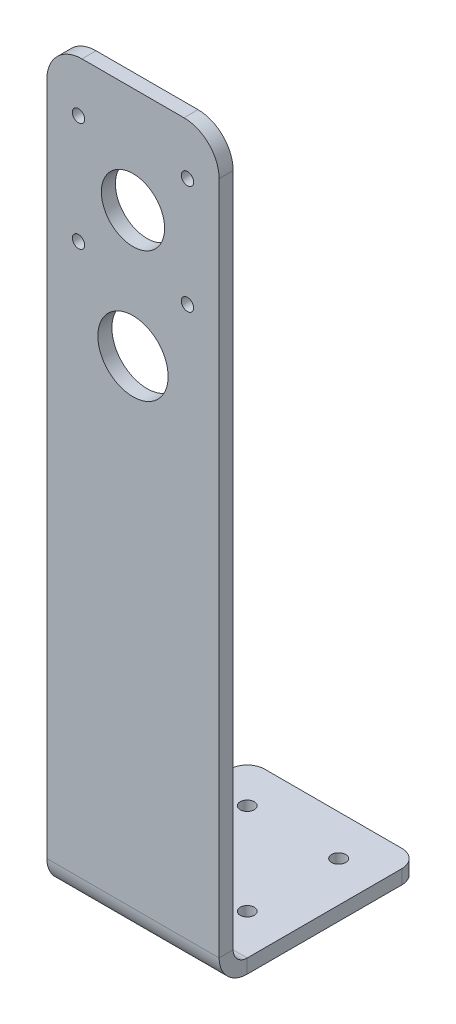
ISO-10303-21;
HEADER;
FILE_DESCRIPTION(('STEP AP214'),'2;1');
FILE_NAME('part.step','',(''),(''),'','','');
FILE_SCHEMA(('AUTOMOTIVE_DESIGN { 1 0 10303 214 1 1 1 1 }'));
ENDSEC;
DATA;
#1=APPLICATION_CONTEXT('core data for automotive mechanical design processes');
#2=APPLICATION_PROTOCOL_DEFINITION('international standard','automotive_design',2000,#1);
#3=PRODUCT_CONTEXT('',#1,'mechanical');
#4=PRODUCT('Part','Part','',(#3));
#5=PRODUCT_RELATED_PRODUCT_CATEGORY('part','',(#4));
#6=PRODUCT_DEFINITION_FORMATION('','',#4);
#7=PRODUCT_DEFINITION_CONTEXT('part definition',#1,'design');
#8=PRODUCT_DEFINITION('design','',#6,#7);
#9=PRODUCT_DEFINITION_SHAPE('','',#8);
#10=(LENGTH_UNIT() NAMED_UNIT(*) SI_UNIT(.MILLI.,.METRE.));
#11=(NAMED_UNIT(*) PLANE_ANGLE_UNIT() SI_UNIT($,.RADIAN.));
#12=(NAMED_UNIT(*) SI_UNIT($,.STERADIAN.) SOLID_ANGLE_UNIT());
#13=UNCERTAINTY_MEASURE_WITH_UNIT(LENGTH_MEASURE(1.E-05),#10,'distance_accuracy_value','');
#14=(GEOMETRIC_REPRESENTATION_CONTEXT(3) GLOBAL_UNCERTAINTY_ASSIGNED_CONTEXT((#13)) GLOBAL_UNIT_ASSIGNED_CONTEXT((#10,
#11,#12)) REPRESENTATION_CONTEXT('',''));
#15=CARTESIAN_POINT('',(0.,0.,0.));
#16=DIRECTION('',(0.,0.,1.));
#17=DIRECTION('',(1.,0.,0.));
#18=AXIS2_PLACEMENT_3D('',#15,#16,#17);
#19=CARTESIAN_POINT('',(24.5,-4.,24.5));
#20=DIRECTION('',(1.,0.,0.));
#21=DIRECTION('',(0.,0.,-1.));
#22=AXIS2_PLACEMENT_3D('',#19,#20,#21);
#23=PLANE('',#22);
#24=DIRECTION('',(0.,0.,-1.));
#25=VECTOR('',#24,1.);
#26=CARTESIAN_POINT('',(24.5,-4.,24.5));
#27=LINE('',#26,#25);
#28=CARTESIAN_POINT('',(24.5,-4.,24.5));
#29=VERTEX_POINT('',#28);
#30=CARTESIAN_POINT('',(24.5,-4.,-19.5));
#31=VERTEX_POINT('',#30);
#32=EDGE_CURVE('E235',#29,#31,#27,.T.);
#33=ORIENTED_EDGE('',*,*,#32,.T.);
#34=DIRECTION('',(0.,1.,0.));
#35=VECTOR('',#34,1.);
#36=CARTESIAN_POINT('',(24.5,-4.,-19.5));
#37=LINE('',#36,#35);
#38=CARTESIAN_POINT('',(24.5,0.,-19.5));
#39=VERTEX_POINT('',#38);
#40=EDGE_CURVE('E13',#31,#39,#37,.T.);
#41=ORIENTED_EDGE('',*,*,#40,.T.);
#42=DIRECTION('',(0.,0.,-1.));
#43=VECTOR('',#42,1.);
#44=CARTESIAN_POINT('',(24.5,0.,24.5));
#45=LINE('',#44,#43);
#46=CARTESIAN_POINT('',(24.5,0.,24.5));
#47=VERTEX_POINT('',#46);
#48=EDGE_CURVE('E232',#47,#39,#45,.T.);
#49=ORIENTED_EDGE('',*,*,#48,.F.);
#50=DIRECTION('',(0.,1.,0.));
#51=VECTOR('',#50,1.);
#52=CARTESIAN_POINT('',(24.5,-4.,24.5));
#53=LINE('',#52,#51);
#54=EDGE_CURVE('E254',#29,#47,#53,.T.);
#55=ORIENTED_EDGE('',*,*,#54,.F.);
#56=EDGE_LOOP('',(#33,#41,#49,#55));
#57=FACE_BOUND('',#56,.T.);
#58=ADVANCED_FACE('F58',(#57),#23,.T.);
#59=CARTESIAN_POINT('',(-24.5,-4.,24.5));
#60=DIRECTION('',(-1.,0.,0.));
#61=DIRECTION('',(0.,0.,1.));
#62=AXIS2_PLACEMENT_3D('',#59,#60,#61);
#63=PLANE('',#62);
#64=DIRECTION('',(0.,0.,1.));
#65=VECTOR('',#64,1.);
#66=CARTESIAN_POINT('',(-24.5,0.,24.5));
#67=LINE('',#66,#65);
#68=CARTESIAN_POINT('',(-24.5,0.,-19.5));
#69=VERTEX_POINT('',#68);
#70=CARTESIAN_POINT('',(-24.5,0.,24.5));
#71=VERTEX_POINT('',#70);
#72=EDGE_CURVE('E250',#69,#71,#67,.T.);
#73=ORIENTED_EDGE('',*,*,#72,.F.);
#74=DIRECTION('',(0.,1.,0.));
#75=VECTOR('',#74,1.);
#76=CARTESIAN_POINT('',(-24.5,-4.,-19.5));
#77=LINE('',#76,#75);
#78=CARTESIAN_POINT('',(-24.5,-4.,-19.5));
#79=VERTEX_POINT('',#78);
#80=EDGE_CURVE('E81',#69,#79,#77,.F.);
#81=ORIENTED_EDGE('',*,*,#80,.T.);
#82=DIRECTION('',(0.,0.,1.));
#83=VECTOR('',#82,1.);
#84=CARTESIAN_POINT('',(-24.5,-4.,24.5));
#85=LINE('',#84,#83);
#86=CARTESIAN_POINT('',(-24.5,-4.,24.5));
#87=VERTEX_POINT('',#86);
#88=EDGE_CURVE('E241',#79,#87,#85,.T.);
#89=ORIENTED_EDGE('',*,*,#88,.T.);
#90=DIRECTION('',(0.,1.,0.));
#91=VECTOR('',#90,1.);
#92=CARTESIAN_POINT('',(-24.5,-4.,24.5));
#93=LINE('',#92,#91);
#94=EDGE_CURVE('E244',#87,#71,#93,.T.);
#95=ORIENTED_EDGE('',*,*,#94,.T.);
#96=EDGE_LOOP('',(#73,#81,#89,#95));
#97=FACE_BOUND('',#96,.T.);
#98=ADVANCED_FACE('F296',(#97),#63,.T.);
#99=CARTESIAN_POINT('',(-24.5,-4.,-24.5));
#100=DIRECTION('',(0.,0.,-1.));
#101=DIRECTION('',(-1.,0.,0.));
#102=AXIS2_PLACEMENT_3D('',#99,#100,#101);
#103=PLANE('',#102);
#104=DIRECTION('',(-1.,0.,0.));
#105=VECTOR('',#104,1.);
#106=CARTESIAN_POINT('',(-24.5,-4.,-24.5));
#107=LINE('',#106,#105);
#108=CARTESIAN_POINT('',(19.5,-4.,-24.5));
#109=VERTEX_POINT('',#108);
#110=CARTESIAN_POINT('',(-19.5,-4.,-24.5));
#111=VERTEX_POINT('',#110);
#112=EDGE_CURVE('E237',#109,#111,#107,.T.);
#113=ORIENTED_EDGE('',*,*,#112,.T.);
#114=DIRECTION('',(0.,1.,0.));
#115=VECTOR('',#114,1.);
#116=CARTESIAN_POINT('',(-19.5,-4.,-24.5));
#117=LINE('',#116,#115);
#118=CARTESIAN_POINT('',(-19.5,0.,-24.5));
#119=VERTEX_POINT('',#118);
#120=EDGE_CURVE('E277',#111,#119,#117,.T.);
#121=ORIENTED_EDGE('',*,*,#120,.T.);
#122=DIRECTION('',(-1.,0.,0.));
#123=VECTOR('',#122,1.);
#124=CARTESIAN_POINT('',(-24.5,0.,-24.5));
#125=LINE('',#124,#123);
#126=CARTESIAN_POINT('',(19.5,0.,-24.5));
#127=VERTEX_POINT('',#126);
#128=EDGE_CURVE('E247',#127,#119,#125,.T.);
#129=ORIENTED_EDGE('',*,*,#128,.F.);
#130=DIRECTION('',(0.,1.,0.));
#131=VECTOR('',#130,1.);
#132=CARTESIAN_POINT('',(19.5,-4.,-24.5));
#133=LINE('',#132,#131);
#134=EDGE_CURVE('E275',#127,#109,#133,.F.);
#135=ORIENTED_EDGE('',*,*,#134,.T.);
#136=EDGE_LOOP('',(#113,#121,#129,#135));
#137=FACE_BOUND('',#136,.T.);
#138=ADVANCED_FACE('F290',(#137),#103,.T.);
#139=CARTESIAN_POINT('',(0.,-4.,0.));
#140=DIRECTION('',(0.,-1.,0.));
#141=DIRECTION('',(0.,0.,-1.));
#142=AXIS2_PLACEMENT_3D('',#139,#140,#141);
#143=PLANE('',#142);
#144=CARTESIAN_POINT('',(13.,-4.,13.));
#145=DIRECTION('',(0.,1.,0.));
#146=DIRECTION('',(0.,0.,1.));
#147=AXIS2_PLACEMENT_3D('',#144,#145,#146);
#148=CIRCLE('',#147,2.);
#149=CARTESIAN_POINT('',(13.,-4.,15.));
#150=VERTEX_POINT('',#149);
#151=EDGE_CURVE('E211',#150,#150,#148,.T.);
#152=ORIENTED_EDGE('',*,*,#151,.T.);
#153=EDGE_LOOP('',(#152));
#154=FACE_BOUND('',#153,.T.);
#155=CARTESIAN_POINT('',(13.,-4.,-13.));
#156=DIRECTION('',(0.,1.,0.));
#157=DIRECTION('',(0.,0.,1.));
#158=AXIS2_PLACEMENT_3D('',#155,#156,#157);
#159=CIRCLE('',#158,2.);
#160=CARTESIAN_POINT('',(13.,-4.,-11.));
#161=VERTEX_POINT('',#160);
#162=EDGE_CURVE('E217',#161,#161,#159,.T.);
#163=ORIENTED_EDGE('',*,*,#162,.T.);
#164=EDGE_LOOP('',(#163));
#165=FACE_BOUND('',#164,.T.);
#166=CARTESIAN_POINT('',(-13.,-4.,-13.));
#167=DIRECTION('',(0.,1.,0.));
#168=DIRECTION('',(0.,0.,1.));
#169=AXIS2_PLACEMENT_3D('',#166,#167,#168);
#170=CIRCLE('',#169,2.);
#171=CARTESIAN_POINT('',(-13.,-4.,-11.));
#172=VERTEX_POINT('',#171);
#173=EDGE_CURVE('E223',#172,#172,#170,.T.);
#174=ORIENTED_EDGE('',*,*,#173,.T.);
#175=EDGE_LOOP('',(#174));
#176=FACE_BOUND('',#175,.T.);
#177=CARTESIAN_POINT('',(-13.,-4.,13.));
#178=DIRECTION('',(0.,1.,0.));
#179=DIRECTION('',(0.,0.,1.));
#180=AXIS2_PLACEMENT_3D('',#177,#178,#179);
#181=CIRCLE('',#180,2.);
#182=CARTESIAN_POINT('',(-13.,-4.,15.));
#183=VERTEX_POINT('',#182);
#184=EDGE_CURVE('E229',#183,#183,#181,.T.);
#185=ORIENTED_EDGE('',*,*,#184,.T.);
#186=EDGE_LOOP('',(#185));
#187=FACE_BOUND('',#186,.T.);
#188=ORIENTED_EDGE('',*,*,#88,.F.);
#189=CARTESIAN_POINT('',(-19.5,-4.,-19.5));
#190=DIRECTION('',(0.,-1.,0.));
#191=DIRECTION('',(0.,0.,-1.));
#192=AXIS2_PLACEMENT_3D('',#189,#190,#191);
#193=CIRCLE('',#192,5.);
#194=EDGE_CURVE('E66',#79,#111,#193,.T.);
#195=ORIENTED_EDGE('',*,*,#194,.T.);
#196=ORIENTED_EDGE('',*,*,#112,.F.);
#197=CARTESIAN_POINT('',(19.5,-4.,-19.5));
#198=DIRECTION('',(0.,-1.,0.));
#199=DIRECTION('',(0.,0.,-1.));
#200=AXIS2_PLACEMENT_3D('',#197,#198,#199);
#201=CIRCLE('',#200,5.);
#202=EDGE_CURVE('E73',#109,#31,#201,.T.);
#203=ORIENTED_EDGE('',*,*,#202,.T.);
#204=ORIENTED_EDGE('',*,*,#32,.F.);
#205=DIRECTION('',(1.,0.,0.));
#206=VECTOR('',#205,1.);
#207=CARTESIAN_POINT('',(-24.5,-4.,24.5));
#208=LINE('',#207,#206);
#209=EDGE_CURVE('E158',#87,#29,#208,.T.);
#210=ORIENTED_EDGE('',*,*,#209,.F.);
#211=EDGE_LOOP('',(#188,#195,#196,#203,#204,#210));
#212=FACE_BOUND('',#211,.T.);
#213=ADVANCED_FACE('F286',(#154,#165,#176,#187,#212),#143,.T.);
#214=CARTESIAN_POINT('',(0.,0.,0.));
#215=DIRECTION('',(0.,-1.,0.));
#216=DIRECTION('',(0.,0.,-1.));
#217=AXIS2_PLACEMENT_3D('',#214,#215,#216);
#218=PLANE('',#217);
#219=CARTESIAN_POINT('',(13.,0.,13.));
#220=DIRECTION('',(0.,1.,0.));
#221=DIRECTION('',(0.,0.,1.));
#222=AXIS2_PLACEMENT_3D('',#219,#220,#221);
#223=CIRCLE('',#222,2.);
#224=CARTESIAN_POINT('',(13.,0.,15.));
#225=VERTEX_POINT('',#224);
#226=EDGE_CURVE('E206',#225,#225,#223,.T.);
#227=ORIENTED_EDGE('',*,*,#226,.F.);
#228=EDGE_LOOP('',(#227));
#229=FACE_BOUND('',#228,.T.);
#230=CARTESIAN_POINT('',(13.,0.,-13.));
#231=DIRECTION('',(0.,1.,0.));
#232=DIRECTION('',(0.,0.,1.));
#233=AXIS2_PLACEMENT_3D('',#230,#231,#232);
#234=CIRCLE('',#233,2.);
#235=CARTESIAN_POINT('',(13.,0.,-11.));
#236=VERTEX_POINT('',#235);
#237=EDGE_CURVE('E214',#236,#236,#234,.T.);
#238=ORIENTED_EDGE('',*,*,#237,.F.);
#239=EDGE_LOOP('',(#238));
#240=FACE_BOUND('',#239,.T.);
#241=CARTESIAN_POINT('',(-13.,0.,-13.));
#242=DIRECTION('',(0.,1.,0.));
#243=DIRECTION('',(0.,0.,1.));
#244=AXIS2_PLACEMENT_3D('',#241,#242,#243);
#245=CIRCLE('',#244,2.);
#246=CARTESIAN_POINT('',(-13.,0.,-11.));
#247=VERTEX_POINT('',#246);
#248=EDGE_CURVE('E220',#247,#247,#245,.T.);
#249=ORIENTED_EDGE('',*,*,#248,.F.);
#250=EDGE_LOOP('',(#249));
#251=FACE_BOUND('',#250,.T.);
#252=CARTESIAN_POINT('',(-13.,0.,13.));
#253=DIRECTION('',(0.,1.,0.));
#254=DIRECTION('',(0.,0.,1.));
#255=AXIS2_PLACEMENT_3D('',#252,#253,#254);
#256=CIRCLE('',#255,2.);
#257=CARTESIAN_POINT('',(-13.,0.,15.));
#258=VERTEX_POINT('',#257);
#259=EDGE_CURVE('E226',#258,#258,#256,.T.);
#260=ORIENTED_EDGE('',*,*,#259,.F.);
#261=EDGE_LOOP('',(#260));
#262=FACE_BOUND('',#261,.T.);
#263=ORIENTED_EDGE('',*,*,#128,.T.);
#264=CARTESIAN_POINT('',(-19.5,0.,-19.5));
#265=DIRECTION('',(0.,-1.,0.));
#266=DIRECTION('',(0.,0.,-1.));
#267=AXIS2_PLACEMENT_3D('',#264,#265,#266);
#268=CIRCLE('',#267,5.);
#269=EDGE_CURVE('E282',#119,#69,#268,.F.);
#270=ORIENTED_EDGE('',*,*,#269,.T.);
#271=ORIENTED_EDGE('',*,*,#72,.T.);
#272=DIRECTION('',(1.,0.,0.));
#273=VECTOR('',#272,1.);
#274=CARTESIAN_POINT('',(-24.5,0.,24.5));
#275=LINE('',#274,#273);
#276=EDGE_CURVE('E238',#71,#47,#275,.T.);
#277=ORIENTED_EDGE('',*,*,#276,.T.);
#278=ORIENTED_EDGE('',*,*,#48,.T.);
#279=CARTESIAN_POINT('',(19.5,0.,-19.5));
#280=DIRECTION('',(0.,-1.,0.));
#281=DIRECTION('',(0.,0.,-1.));
#282=AXIS2_PLACEMENT_3D('',#279,#280,#281);
#283=CIRCLE('',#282,5.);
#284=EDGE_CURVE('E280',#39,#127,#283,.F.);
#285=ORIENTED_EDGE('',*,*,#284,.T.);
#286=EDGE_LOOP('',(#263,#270,#271,#277,#278,#285));
#287=FACE_BOUND('',#286,.T.);
#288=ADVANCED_FACE('F295',(#229,#240,#251,#262,#287),#218,.F.);
#289=CARTESIAN_POINT('',(-13.,-4.,13.));
#290=DIRECTION('',(0.,1.,0.));
#291=DIRECTION('',(0.,0.,1.));
#292=AXIS2_PLACEMENT_3D('',#289,#290,#291);
#293=CYLINDRICAL_SURFACE('',#292,2.);
#294=ORIENTED_EDGE('',*,*,#184,.F.);
#295=EDGE_LOOP('',(#294));
#296=FACE_BOUND('',#295,.T.);
#297=ORIENTED_EDGE('',*,*,#259,.T.);
#298=EDGE_LOOP('',(#297));
#299=FACE_BOUND('',#298,.T.);
#300=ADVANCED_FACE('F343',(#296,#299),#293,.F.);
#301=CARTESIAN_POINT('',(-13.,-4.,-13.));
#302=DIRECTION('',(0.,1.,0.));
#303=DIRECTION('',(0.,0.,1.));
#304=AXIS2_PLACEMENT_3D('',#301,#302,#303);
#305=CYLINDRICAL_SURFACE('',#304,2.);
#306=ORIENTED_EDGE('',*,*,#173,.F.);
#307=EDGE_LOOP('',(#306));
#308=FACE_BOUND('',#307,.T.);
#309=ORIENTED_EDGE('',*,*,#248,.T.);
#310=EDGE_LOOP('',(#309));
#311=FACE_BOUND('',#310,.T.);
#312=ADVANCED_FACE('F350',(#308,#311),#305,.F.);
#313=CARTESIAN_POINT('',(13.,-4.,-13.));
#314=DIRECTION('',(0.,1.,0.));
#315=DIRECTION('',(0.,0.,1.));
#316=AXIS2_PLACEMENT_3D('',#313,#314,#315);
#317=CYLINDRICAL_SURFACE('',#316,2.);
#318=ORIENTED_EDGE('',*,*,#162,.F.);
#319=EDGE_LOOP('',(#318));
#320=FACE_BOUND('',#319,.T.);
#321=ORIENTED_EDGE('',*,*,#237,.T.);
#322=EDGE_LOOP('',(#321));
#323=FACE_BOUND('',#322,.T.);
#324=ADVANCED_FACE('F354',(#320,#323),#317,.F.);
#325=CARTESIAN_POINT('',(13.,-4.,13.));
#326=DIRECTION('',(0.,1.,0.));
#327=DIRECTION('',(0.,0.,1.));
#328=AXIS2_PLACEMENT_3D('',#325,#326,#327);
#329=CYLINDRICAL_SURFACE('',#328,2.);
#330=ORIENTED_EDGE('',*,*,#151,.F.);
#331=EDGE_LOOP('',(#330));
#332=FACE_BOUND('',#331,.T.);
#333=ORIENTED_EDGE('',*,*,#226,.T.);
#334=EDGE_LOOP('',(#333));
#335=FACE_BOUND('',#334,.T.);
#336=ADVANCED_FACE('F358',(#332,#335),#329,.F.);
#337=CARTESIAN_POINT('',(-24.5,3.99999999999999,24.5));
#338=DIRECTION('',(-1.,0.,0.));
#339=DIRECTION('',(0.,0.,1.));
#340=AXIS2_PLACEMENT_3D('',#337,#338,#339);
#341=PLANE('',#340);
#342=DIRECTION('',(0.,0.,-1.));
#343=VECTOR('',#342,1.);
#344=CARTESIAN_POINT('',(-24.5,3.99999999999999,32.5));
#345=LINE('',#344,#343);
#346=CARTESIAN_POINT('',(-24.5,3.99999999999999,28.5));
#347=VERTEX_POINT('',#346);
#348=CARTESIAN_POINT('',(-24.5,3.99999999999999,32.5));
#349=VERTEX_POINT('',#348);
#350=EDGE_CURVE('E202',#347,#349,#345,.F.);
#351=ORIENTED_EDGE('',*,*,#350,.F.);
#352=CARTESIAN_POINT('',(-24.5,3.99999999999999,24.5));
#353=DIRECTION('',(1.,0.,0.));
#354=DIRECTION('',(0.,0.,-1.));
#355=AXIS2_PLACEMENT_3D('',#352,#353,#354);
#356=CIRCLE('',#355,3.99999999999999);
#357=EDGE_CURVE('E162',#71,#347,#356,.F.);
#358=ORIENTED_EDGE('',*,*,#357,.F.);
#359=ORIENTED_EDGE('',*,*,#94,.F.);
#360=CARTESIAN_POINT('',(-24.5,3.99999999999999,24.5));
#361=DIRECTION('',(1.,0.,0.));
#362=DIRECTION('',(0.,0.,-1.));
#363=AXIS2_PLACEMENT_3D('',#360,#361,#362);
#364=CIRCLE('',#363,7.99999999999999);
#365=EDGE_CURVE('E161',#87,#349,#364,.F.);
#366=ORIENTED_EDGE('',*,*,#365,.T.);
#367=EDGE_LOOP('',(#351,#358,#359,#366));
#368=FACE_BOUND('',#367,.T.);
#369=ADVANCED_FACE('F305',(#368),#341,.T.);
#370=CARTESIAN_POINT('',(24.5,3.99999999999999,24.5));
#371=DIRECTION('',(-1.,0.,0.));
#372=DIRECTION('',(0.,0.,1.));
#373=AXIS2_PLACEMENT_3D('',#370,#371,#372);
#374=PLANE('',#373);
#375=CARTESIAN_POINT('',(24.5,3.99999999999999,24.5));
#376=DIRECTION('',(1.,0.,0.));
#377=DIRECTION('',(0.,0.,-1.));
#378=AXIS2_PLACEMENT_3D('',#375,#376,#377);
#379=CIRCLE('',#378,3.99999999999999);
#380=CARTESIAN_POINT('',(24.5,3.99999999999999,28.5));
#381=VERTEX_POINT('',#380);
#382=EDGE_CURVE('E169',#381,#47,#379,.T.);
#383=ORIENTED_EDGE('',*,*,#382,.F.);
#384=DIRECTION('',(0.,0.,-1.));
#385=VECTOR('',#384,1.);
#386=CARTESIAN_POINT('',(24.5,3.99999999999999,28.5));
#387=LINE('',#386,#385);
#388=CARTESIAN_POINT('',(24.5,3.99999999999999,32.5));
#389=VERTEX_POINT('',#388);
#390=EDGE_CURVE('E166',#381,#389,#387,.F.);
#391=ORIENTED_EDGE('',*,*,#390,.T.);
#392=CARTESIAN_POINT('',(24.5,3.99999999999999,24.5));
#393=DIRECTION('',(1.,0.,0.));
#394=DIRECTION('',(0.,0.,-1.));
#395=AXIS2_PLACEMENT_3D('',#392,#393,#394);
#396=CIRCLE('',#395,7.99999999999999);
#397=EDGE_CURVE('E150',#389,#29,#396,.T.);
#398=ORIENTED_EDGE('',*,*,#397,.T.);
#399=ORIENTED_EDGE('',*,*,#54,.T.);
#400=EDGE_LOOP('',(#383,#391,#398,#399));
#401=FACE_BOUND('',#400,.T.);
#402=ADVANCED_FACE('F167',(#401),#374,.F.);
#403=CARTESIAN_POINT('',(24.5,3.99999999999999,24.5));
#404=DIRECTION('',(1.,0.,0.));
#405=DIRECTION('',(0.,0.,1.));
#406=AXIS2_PLACEMENT_3D('',#403,#404,#405);
#407=CYLINDRICAL_SURFACE('',#406,7.99999999999999);
#408=ORIENTED_EDGE('',*,*,#209,.T.);
#409=ORIENTED_EDGE('',*,*,#397,.F.);
#410=DIRECTION('',(1.,0.,0.));
#411=VECTOR('',#410,1.);
#412=CARTESIAN_POINT('',(-24.5,3.99999999999999,32.5));
#413=LINE('',#412,#411);
#414=EDGE_CURVE('E155',#389,#349,#413,.F.);
#415=ORIENTED_EDGE('',*,*,#414,.T.);
#416=ORIENTED_EDGE('',*,*,#365,.F.);
#417=EDGE_LOOP('',(#408,#409,#415,#416));
#418=FACE_BOUND('',#417,.T.);
#419=ADVANCED_FACE('F152',(#418),#407,.T.);
#420=CARTESIAN_POINT('',(24.5,3.99999999999999,24.5));
#421=DIRECTION('',(1.,0.,0.));
#422=DIRECTION('',(0.,0.,1.));
#423=AXIS2_PLACEMENT_3D('',#420,#421,#422);
#424=CYLINDRICAL_SURFACE('',#423,3.99999999999999);
#425=ORIENTED_EDGE('',*,*,#276,.F.);
#426=ORIENTED_EDGE('',*,*,#357,.T.);
#427=DIRECTION('',(1.,0.,0.));
#428=VECTOR('',#427,1.);
#429=CARTESIAN_POINT('',(-24.5,3.99999999999999,28.5));
#430=LINE('',#429,#428);
#431=EDGE_CURVE('E174',#347,#381,#430,.T.);
#432=ORIENTED_EDGE('',*,*,#431,.T.);
#433=ORIENTED_EDGE('',*,*,#382,.T.);
#434=EDGE_LOOP('',(#425,#426,#432,#433));
#435=FACE_BOUND('',#434,.T.);
#436=ADVANCED_FACE('F302',(#435),#424,.F.);
#437=CARTESIAN_POINT('',(-24.5,0.,32.5));
#438=DIRECTION('',(1.,0.,0.));
#439=DIRECTION('',(0.,0.,-1.));
#440=AXIS2_PLACEMENT_3D('',#437,#438,#439);
#441=PLANE('',#440);
#442=DIRECTION('',(0.,-1.,0.));
#443=VECTOR('',#442,1.);
#444=CARTESIAN_POINT('',(-24.5,0.,32.5));
#445=LINE('',#444,#443);
#446=CARTESIAN_POINT('',(-24.5,196.,32.5));
#447=VERTEX_POINT('',#446);
#448=EDGE_CURVE('E182',#447,#349,#445,.T.);
#449=ORIENTED_EDGE('',*,*,#448,.F.);
#450=DIRECTION('',(0.,0.,-1.));
#451=VECTOR('',#450,1.);
#452=CARTESIAN_POINT('',(-24.5,196.,32.5));
#453=LINE('',#452,#451);
#454=CARTESIAN_POINT('',(-24.5,196.,28.5));
#455=VERTEX_POINT('',#454);
#456=EDGE_CURVE('E272',#447,#455,#453,.T.);
#457=ORIENTED_EDGE('',*,*,#456,.T.);
#458=DIRECTION('',(0.,1.,0.));
#459=VECTOR('',#458,1.);
#460=CARTESIAN_POINT('',(-24.5,0.,28.5));
#461=LINE('',#460,#459);
#462=EDGE_CURVE('E183',#455,#347,#461,.F.);
#463=ORIENTED_EDGE('',*,*,#462,.T.);
#464=ORIENTED_EDGE('',*,*,#350,.T.);
#465=EDGE_LOOP('',(#449,#457,#463,#464));
#466=FACE_BOUND('',#465,.T.);
#467=ADVANCED_FACE('F307',(#466),#441,.F.);
#468=CARTESIAN_POINT('',(24.5,206.,32.5));
#469=DIRECTION('',(-1.,0.,0.));
#470=DIRECTION('',(0.,-1.,0.));
#471=AXIS2_PLACEMENT_3D('',#468,#469,#470);
#472=PLANE('',#471);
#473=DIRECTION('',(0.,-1.,0.));
#474=VECTOR('',#473,1.);
#475=CARTESIAN_POINT('',(24.5,206.,28.5));
#476=LINE('',#475,#474);
#477=CARTESIAN_POINT('',(24.5,196.,28.5));
#478=VERTEX_POINT('',#477);
#479=EDGE_CURVE('E198',#381,#478,#476,.F.);
#480=ORIENTED_EDGE('',*,*,#479,.T.);
#481=DIRECTION('',(0.,0.,-1.));
#482=VECTOR('',#481,1.);
#483=CARTESIAN_POINT('',(24.5,196.,32.5));
#484=LINE('',#483,#482);
#485=CARTESIAN_POINT('',(24.5,196.,32.5));
#486=VERTEX_POINT('',#485);
#487=EDGE_CURVE('E187',#478,#486,#484,.F.);
#488=ORIENTED_EDGE('',*,*,#487,.T.);
#489=DIRECTION('',(0.,1.,0.));
#490=VECTOR('',#489,1.);
#491=CARTESIAN_POINT('',(24.5,0.,32.5));
#492=LINE('',#491,#490);
#493=EDGE_CURVE('E179',#389,#486,#492,.T.);
#494=ORIENTED_EDGE('',*,*,#493,.F.);
#495=ORIENTED_EDGE('',*,*,#390,.F.);
#496=EDGE_LOOP('',(#480,#488,#494,#495));
#497=FACE_BOUND('',#496,.T.);
#498=ADVANCED_FACE('F185',(#497),#472,.F.);
#499=CARTESIAN_POINT('',(0.,0.,32.5));
#500=DIRECTION('',(0.,0.,-1.));
#501=DIRECTION('',(-1.,0.,0.));
#502=AXIS2_PLACEMENT_3D('',#499,#500,#501);
#503=PLANE('',#502);
#504=CARTESIAN_POINT('',(15.5,160.5,32.5));
#505=DIRECTION('',(0.,0.,-1.));
#506=DIRECTION('',(-1.,0.,0.));
#507=AXIS2_PLACEMENT_3D('',#504,#505,#506);
#508=CIRCLE('',#507,1.75);
#509=CARTESIAN_POINT('',(13.75,160.5,32.5));
#510=VERTEX_POINT('',#509);
#511=EDGE_CURVE('E419',#510,#510,#508,.T.);
#512=ORIENTED_EDGE('',*,*,#511,.T.);
#513=EDGE_LOOP('',(#512));
#514=FACE_BOUND('',#513,.T.);
#515=CARTESIAN_POINT('',(15.5,191.5,32.5));
#516=DIRECTION('',(0.,0.,-1.));
#517=DIRECTION('',(-1.,0.,0.));
#518=AXIS2_PLACEMENT_3D('',#515,#516,#517);
#519=CIRCLE('',#518,1.75);
#520=CARTESIAN_POINT('',(13.75,191.5,32.5));
#521=VERTEX_POINT('',#520);
#522=EDGE_CURVE('E426',#521,#521,#519,.T.);
#523=ORIENTED_EDGE('',*,*,#522,.T.);
#524=EDGE_LOOP('',(#523));
#525=FACE_BOUND('',#524,.T.);
#526=CARTESIAN_POINT('',(-15.5,191.5,32.5));
#527=DIRECTION('',(0.,0.,-1.));
#528=DIRECTION('',(-1.,0.,0.));
#529=AXIS2_PLACEMENT_3D('',#526,#527,#528);
#530=CIRCLE('',#529,1.75);
#531=CARTESIAN_POINT('',(-17.25,191.5,32.5));
#532=VERTEX_POINT('',#531);
#533=EDGE_CURVE('E432',#532,#532,#530,.T.);
#534=ORIENTED_EDGE('',*,*,#533,.T.);
#535=EDGE_LOOP('',(#534));
#536=FACE_BOUND('',#535,.T.);
#537=CARTESIAN_POINT('',(-15.5,160.5,32.5));
#538=DIRECTION('',(0.,0.,-1.));
#539=DIRECTION('',(-1.,0.,0.));
#540=AXIS2_PLACEMENT_3D('',#537,#538,#539);
#541=CIRCLE('',#540,1.75);
#542=CARTESIAN_POINT('',(-17.25,160.5,32.5));
#543=VERTEX_POINT('',#542);
#544=EDGE_CURVE('E410',#543,#543,#541,.T.);
#545=ORIENTED_EDGE('',*,*,#544,.T.);
#546=EDGE_LOOP('',(#545));
#547=FACE_BOUND('',#546,.T.);
#548=CARTESIAN_POINT('',(0.,176.,32.5));
#549=DIRECTION('',(0.,0.,-1.));
#550=DIRECTION('',(-1.,0.,0.));
#551=AXIS2_PLACEMENT_3D('',#548,#549,#550);
#552=CIRCLE('',#551,9.00000000000001);
#553=CARTESIAN_POINT('',(-9.00000000000001,176.,32.5));
#554=VERTEX_POINT('',#553);
#555=EDGE_CURVE('E437',#554,#554,#552,.T.);
#556=ORIENTED_EDGE('',*,*,#555,.T.);
#557=EDGE_LOOP('',(#556));
#558=FACE_BOUND('',#557,.T.);
#559=CARTESIAN_POINT('',(0.,140.,32.5));
#560=DIRECTION('',(0.,0.,-1.));
#561=DIRECTION('',(-1.,0.,0.));
#562=AXIS2_PLACEMENT_3D('',#559,#560,#561);
#563=CIRCLE('',#562,10.);
#564=CARTESIAN_POINT('',(-10.,140.,32.5));
#565=VERTEX_POINT('',#564);
#566=EDGE_CURVE('E205',#565,#565,#563,.T.);
#567=ORIENTED_EDGE('',*,*,#566,.T.);
#568=EDGE_LOOP('',(#567));
#569=FACE_BOUND('',#568,.T.);
#570=ORIENTED_EDGE('',*,*,#493,.T.);
#571=CARTESIAN_POINT('',(14.5,196.,32.5));
#572=DIRECTION('',(0.,0.,-1.));
#573=DIRECTION('',(-1.,0.,0.));
#574=AXIS2_PLACEMENT_3D('',#571,#572,#573);
#575=CIRCLE('',#574,10.);
#576=CARTESIAN_POINT('',(14.5,206.,32.5));
#577=VERTEX_POINT('',#576);
#578=EDGE_CURVE('E270',#486,#577,#575,.F.);
#579=ORIENTED_EDGE('',*,*,#578,.T.);
#580=DIRECTION('',(-1.,0.,0.));
#581=VECTOR('',#580,1.);
#582=CARTESIAN_POINT('',(0.,206.,32.5));
#583=LINE('',#582,#581);
#584=CARTESIAN_POINT('',(-14.5,206.,32.5));
#585=VERTEX_POINT('',#584);
#586=EDGE_CURVE('E188',#577,#585,#583,.T.);
#587=ORIENTED_EDGE('',*,*,#586,.T.);
#588=CARTESIAN_POINT('',(-14.5,196.,32.5));
#589=DIRECTION('',(0.,0.,-1.));
#590=DIRECTION('',(-1.,0.,0.));
#591=AXIS2_PLACEMENT_3D('',#588,#589,#590);
#592=CIRCLE('',#591,10.);
#593=EDGE_CURVE('E268',#585,#447,#592,.F.);
#594=ORIENTED_EDGE('',*,*,#593,.T.);
#595=ORIENTED_EDGE('',*,*,#448,.T.);
#596=ORIENTED_EDGE('',*,*,#414,.F.);
#597=EDGE_LOOP('',(#570,#579,#587,#594,#595,#596));
#598=FACE_BOUND('',#597,.T.);
#599=ADVANCED_FACE('F178',(#514,#525,#536,#547,#558,#569,#598),#503,.F.);
#600=CARTESIAN_POINT('',(0.,0.,28.5));
#601=DIRECTION('',(0.,0.,-1.));
#602=DIRECTION('',(-1.,0.,0.));
#603=AXIS2_PLACEMENT_3D('',#600,#601,#602);
#604=PLANE('',#603);
#605=CARTESIAN_POINT('',(15.5,160.5,28.5));
#606=DIRECTION('',(0.,0.,-1.));
#607=DIRECTION('',(-1.,0.,0.));
#608=AXIS2_PLACEMENT_3D('',#605,#606,#607);
#609=CIRCLE('',#608,1.75);
#610=CARTESIAN_POINT('',(13.75,160.5,28.5));
#611=VERTEX_POINT('',#610);
#612=EDGE_CURVE('E423',#611,#611,#609,.T.);
#613=ORIENTED_EDGE('',*,*,#612,.F.);
#614=EDGE_LOOP('',(#613));
#615=FACE_BOUND('',#614,.T.);
#616=CARTESIAN_POINT('',(15.5,191.5,28.5));
#617=DIRECTION('',(0.,0.,-1.));
#618=DIRECTION('',(-1.,0.,0.));
#619=AXIS2_PLACEMENT_3D('',#616,#617,#618);
#620=CIRCLE('',#619,1.75);
#621=CARTESIAN_POINT('',(13.75,191.5,28.5));
#622=VERTEX_POINT('',#621);
#623=EDGE_CURVE('E429',#622,#622,#620,.T.);
#624=ORIENTED_EDGE('',*,*,#623,.F.);
#625=EDGE_LOOP('',(#624));
#626=FACE_BOUND('',#625,.T.);
#627=CARTESIAN_POINT('',(-15.5,191.5,28.5));
#628=DIRECTION('',(0.,0.,-1.));
#629=DIRECTION('',(-1.,0.,0.));
#630=AXIS2_PLACEMENT_3D('',#627,#628,#629);
#631=CIRCLE('',#630,1.75);
#632=CARTESIAN_POINT('',(-17.25,191.5,28.5));
#633=VERTEX_POINT('',#632);
#634=EDGE_CURVE('E416',#633,#633,#631,.T.);
#635=ORIENTED_EDGE('',*,*,#634,.F.);
#636=EDGE_LOOP('',(#635));
#637=FACE_BOUND('',#636,.T.);
#638=CARTESIAN_POINT('',(-15.5,160.5,28.5));
#639=DIRECTION('',(0.,0.,-1.));
#640=DIRECTION('',(-1.,0.,0.));
#641=AXIS2_PLACEMENT_3D('',#638,#639,#640);
#642=CIRCLE('',#641,1.75);
#643=CARTESIAN_POINT('',(-17.25,160.5,28.5));
#644=VERTEX_POINT('',#643);
#645=EDGE_CURVE('E413',#644,#644,#642,.T.);
#646=ORIENTED_EDGE('',*,*,#645,.F.);
#647=EDGE_LOOP('',(#646));
#648=FACE_BOUND('',#647,.T.);
#649=CARTESIAN_POINT('',(0.,176.,28.5));
#650=DIRECTION('',(0.,0.,-1.));
#651=DIRECTION('',(-1.,0.,0.));
#652=AXIS2_PLACEMENT_3D('',#649,#650,#651);
#653=CIRCLE('',#652,9.00000000000001);
#654=CARTESIAN_POINT('',(-9.00000000000001,176.,28.5));
#655=VERTEX_POINT('',#654);
#656=EDGE_CURVE('E422',#655,#655,#653,.T.);
#657=ORIENTED_EDGE('',*,*,#656,.F.);
#658=EDGE_LOOP('',(#657));
#659=FACE_BOUND('',#658,.T.);
#660=CARTESIAN_POINT('',(0.,140.,28.5));
#661=DIRECTION('',(0.,0.,-1.));
#662=DIRECTION('',(-1.,0.,0.));
#663=AXIS2_PLACEMENT_3D('',#660,#661,#662);
#664=CIRCLE('',#663,10.);
#665=CARTESIAN_POINT('',(-10.,140.,28.5));
#666=VERTEX_POINT('',#665);
#667=EDGE_CURVE('E440',#666,#666,#664,.T.);
#668=ORIENTED_EDGE('',*,*,#667,.F.);
#669=EDGE_LOOP('',(#668));
#670=FACE_BOUND('',#669,.T.);
#671=DIRECTION('',(1.,0.,0.));
#672=VECTOR('',#671,1.);
#673=CARTESIAN_POINT('',(-24.5,206.,28.5));
#674=LINE('',#673,#672);
#675=CARTESIAN_POINT('',(14.5,206.,28.5));
#676=VERTEX_POINT('',#675);
#677=CARTESIAN_POINT('',(-14.5,206.,28.5));
#678=VERTEX_POINT('',#677);
#679=EDGE_CURVE('E192',#676,#678,#674,.F.);
#680=ORIENTED_EDGE('',*,*,#679,.F.);
#681=CARTESIAN_POINT('',(14.5,196.,28.5));
#682=DIRECTION('',(0.,0.,-1.));
#683=DIRECTION('',(-1.,0.,0.));
#684=AXIS2_PLACEMENT_3D('',#681,#682,#683);
#685=CIRCLE('',#684,10.);
#686=EDGE_CURVE('E265',#676,#478,#685,.T.);
#687=ORIENTED_EDGE('',*,*,#686,.T.);
#688=ORIENTED_EDGE('',*,*,#479,.F.);
#689=ORIENTED_EDGE('',*,*,#431,.F.);
#690=ORIENTED_EDGE('',*,*,#462,.F.);
#691=CARTESIAN_POINT('',(-14.5,196.,28.5));
#692=DIRECTION('',(0.,0.,-1.));
#693=DIRECTION('',(-1.,0.,0.));
#694=AXIS2_PLACEMENT_3D('',#691,#692,#693);
#695=CIRCLE('',#694,10.);
#696=EDGE_CURVE('E263',#455,#678,#695,.T.);
#697=ORIENTED_EDGE('',*,*,#696,.T.);
#698=EDGE_LOOP('',(#680,#687,#688,#689,#690,#697));
#699=FACE_BOUND('',#698,.T.);
#700=ADVANCED_FACE('F312',(#615,#626,#637,#648,#659,#670,#699),#604,.T.);
#701=CARTESIAN_POINT('',(-24.5,206.,32.5));
#702=DIRECTION('',(0.,-1.,0.));
#703=DIRECTION('',(0.,0.,-1.));
#704=AXIS2_PLACEMENT_3D('',#701,#702,#703);
#705=PLANE('',#704);
#706=ORIENTED_EDGE('',*,*,#586,.F.);
#707=DIRECTION('',(0.,0.,-1.));
#708=VECTOR('',#707,1.);
#709=CARTESIAN_POINT('',(14.5,206.,32.5));
#710=LINE('',#709,#708);
#711=EDGE_CURVE('E260',#577,#676,#710,.T.);
#712=ORIENTED_EDGE('',*,*,#711,.T.);
#713=ORIENTED_EDGE('',*,*,#679,.T.);
#714=DIRECTION('',(0.,0.,-1.));
#715=VECTOR('',#714,1.);
#716=CARTESIAN_POINT('',(-14.5,206.,32.5));
#717=LINE('',#716,#715);
#718=EDGE_CURVE('E256',#678,#585,#717,.F.);
#719=ORIENTED_EDGE('',*,*,#718,.T.);
#720=EDGE_LOOP('',(#706,#712,#713,#719));
#721=FACE_BOUND('',#720,.T.);
#722=ADVANCED_FACE('F319',(#721),#705,.F.);
#723=CARTESIAN_POINT('',(0.,140.,38.5));
#724=DIRECTION('',(0.,0.,-1.));
#725=DIRECTION('',(-1.,0.,0.));
#726=AXIS2_PLACEMENT_3D('',#723,#724,#725);
#727=CYLINDRICAL_SURFACE('',#726,10.);
#728=ORIENTED_EDGE('',*,*,#667,.T.);
#729=EDGE_LOOP('',(#728));
#730=FACE_BOUND('',#729,.T.);
#731=ORIENTED_EDGE('',*,*,#566,.F.);
#732=EDGE_LOOP('',(#731));
#733=FACE_BOUND('',#732,.T.);
#734=ADVANCED_FACE('F377',(#730,#733),#727,.F.);
#735=CARTESIAN_POINT('',(0.,176.,32.5));
#736=DIRECTION('',(0.,0.,-1.));
#737=DIRECTION('',(-1.,0.,0.));
#738=AXIS2_PLACEMENT_3D('',#735,#736,#737);
#739=CYLINDRICAL_SURFACE('',#738,9.00000000000001);
#740=ORIENTED_EDGE('',*,*,#555,.F.);
#741=EDGE_LOOP('',(#740));
#742=FACE_BOUND('',#741,.T.);
#743=ORIENTED_EDGE('',*,*,#656,.T.);
#744=EDGE_LOOP('',(#743));
#745=FACE_BOUND('',#744,.T.);
#746=ADVANCED_FACE('F386',(#742,#745),#739,.F.);
#747=CARTESIAN_POINT('',(-15.5,160.5,32.5));
#748=DIRECTION('',(0.,0.,-1.));
#749=DIRECTION('',(-1.,0.,0.));
#750=AXIS2_PLACEMENT_3D('',#747,#748,#749);
#751=CYLINDRICAL_SURFACE('',#750,1.75);
#752=ORIENTED_EDGE('',*,*,#544,.F.);
#753=EDGE_LOOP('',(#752));
#754=FACE_BOUND('',#753,.T.);
#755=ORIENTED_EDGE('',*,*,#645,.T.);
#756=EDGE_LOOP('',(#755));
#757=FACE_BOUND('',#756,.T.);
#758=ADVANCED_FACE('F390',(#754,#757),#751,.F.);
#759=CARTESIAN_POINT('',(-15.5,191.5,32.5));
#760=DIRECTION('',(0.,0.,-1.));
#761=DIRECTION('',(-1.,0.,0.));
#762=AXIS2_PLACEMENT_3D('',#759,#760,#761);
#763=CYLINDRICAL_SURFACE('',#762,1.75);
#764=ORIENTED_EDGE('',*,*,#533,.F.);
#765=EDGE_LOOP('',(#764));
#766=FACE_BOUND('',#765,.T.);
#767=ORIENTED_EDGE('',*,*,#634,.T.);
#768=EDGE_LOOP('',(#767));
#769=FACE_BOUND('',#768,.T.);
#770=ADVANCED_FACE('F392',(#766,#769),#763,.F.);
#771=CARTESIAN_POINT('',(15.5,191.5,32.5));
#772=DIRECTION('',(0.,0.,-1.));
#773=DIRECTION('',(-1.,0.,0.));
#774=AXIS2_PLACEMENT_3D('',#771,#772,#773);
#775=CYLINDRICAL_SURFACE('',#774,1.75);
#776=ORIENTED_EDGE('',*,*,#522,.F.);
#777=EDGE_LOOP('',(#776));
#778=FACE_BOUND('',#777,.T.);
#779=ORIENTED_EDGE('',*,*,#623,.T.);
#780=EDGE_LOOP('',(#779));
#781=FACE_BOUND('',#780,.T.);
#782=ADVANCED_FACE('F395',(#778,#781),#775,.F.);
#783=CARTESIAN_POINT('',(15.5,160.5,32.5));
#784=DIRECTION('',(0.,0.,-1.));
#785=DIRECTION('',(-1.,0.,0.));
#786=AXIS2_PLACEMENT_3D('',#783,#784,#785);
#787=CYLINDRICAL_SURFACE('',#786,1.75);
#788=ORIENTED_EDGE('',*,*,#511,.F.);
#789=EDGE_LOOP('',(#788));
#790=FACE_BOUND('',#789,.T.);
#791=ORIENTED_EDGE('',*,*,#612,.T.);
#792=EDGE_LOOP('',(#791));
#793=FACE_BOUND('',#792,.T.);
#794=ADVANCED_FACE('F329',(#790,#793),#787,.F.);
#795=CARTESIAN_POINT('',(14.5,196.,32.5));
#796=DIRECTION('',(0.,0.,-1.));
#797=DIRECTION('',(-1.,0.,0.));
#798=AXIS2_PLACEMENT_3D('',#795,#796,#797);
#799=CYLINDRICAL_SURFACE('',#798,10.);
#800=ORIENTED_EDGE('',*,*,#578,.F.);
#801=ORIENTED_EDGE('',*,*,#487,.F.);
#802=ORIENTED_EDGE('',*,*,#686,.F.);
#803=ORIENTED_EDGE('',*,*,#711,.F.);
#804=EDGE_LOOP('',(#800,#801,#802,#803));
#805=FACE_BOUND('',#804,.T.);
#806=ADVANCED_FACE('F314',(#805),#799,.T.);
#807=CARTESIAN_POINT('',(-14.5,196.,32.5));
#808=DIRECTION('',(0.,0.,-1.));
#809=DIRECTION('',(-1.,0.,0.));
#810=AXIS2_PLACEMENT_3D('',#807,#808,#809);
#811=CYLINDRICAL_SURFACE('',#810,10.);
#812=ORIENTED_EDGE('',*,*,#593,.F.);
#813=ORIENTED_EDGE('',*,*,#718,.F.);
#814=ORIENTED_EDGE('',*,*,#696,.F.);
#815=ORIENTED_EDGE('',*,*,#456,.F.);
#816=EDGE_LOOP('',(#812,#813,#814,#815));
#817=FACE_BOUND('',#816,.T.);
#818=ADVANCED_FACE('F322',(#817),#811,.T.);
#819=CARTESIAN_POINT('',(-19.5,-4.,-19.5));
#820=DIRECTION('',(0.,1.,0.));
#821=DIRECTION('',(0.,0.,1.));
#822=AXIS2_PLACEMENT_3D('',#819,#820,#821);
#823=CYLINDRICAL_SURFACE('',#822,5.);
#824=ORIENTED_EDGE('',*,*,#194,.F.);
#825=ORIENTED_EDGE('',*,*,#80,.F.);
#826=ORIENTED_EDGE('',*,*,#269,.F.);
#827=ORIENTED_EDGE('',*,*,#120,.F.);
#828=EDGE_LOOP('',(#824,#825,#826,#827));
#829=FACE_BOUND('',#828,.T.);
#830=ADVANCED_FACE('F293',(#829),#823,.T.);
#831=CARTESIAN_POINT('',(19.5,-4.,-19.5));
#832=DIRECTION('',(0.,1.,0.));
#833=DIRECTION('',(0.,0.,1.));
#834=AXIS2_PLACEMENT_3D('',#831,#832,#833);
#835=CYLINDRICAL_SURFACE('',#834,5.);
#836=ORIENTED_EDGE('',*,*,#202,.F.);
#837=ORIENTED_EDGE('',*,*,#134,.F.);
#838=ORIENTED_EDGE('',*,*,#284,.F.);
#839=ORIENTED_EDGE('',*,*,#40,.F.);
#840=EDGE_LOOP('',(#836,#837,#838,#839));
#841=FACE_BOUND('',#840,.T.);
#842=ADVANCED_FACE('F60',(#841),#835,.T.);
#843=CLOSED_SHELL('',(#58,#98,#138,#213,#288,#300,#312,#324,#336,#369,#402,#419,#436,#467,#498,
#599,#700,#722,#734,#746,#758,#770,#782,#794,#806,#818,#830,#842));
#844=MANIFOLD_SOLID_BREP('B2',#843);
#845=ADVANCED_BREP_SHAPE_REPRESENTATION('',(#18,#844),#14);
#846=SHAPE_DEFINITION_REPRESENTATION(#9,#845);
ENDSEC;
END-ISO-10303-21;
